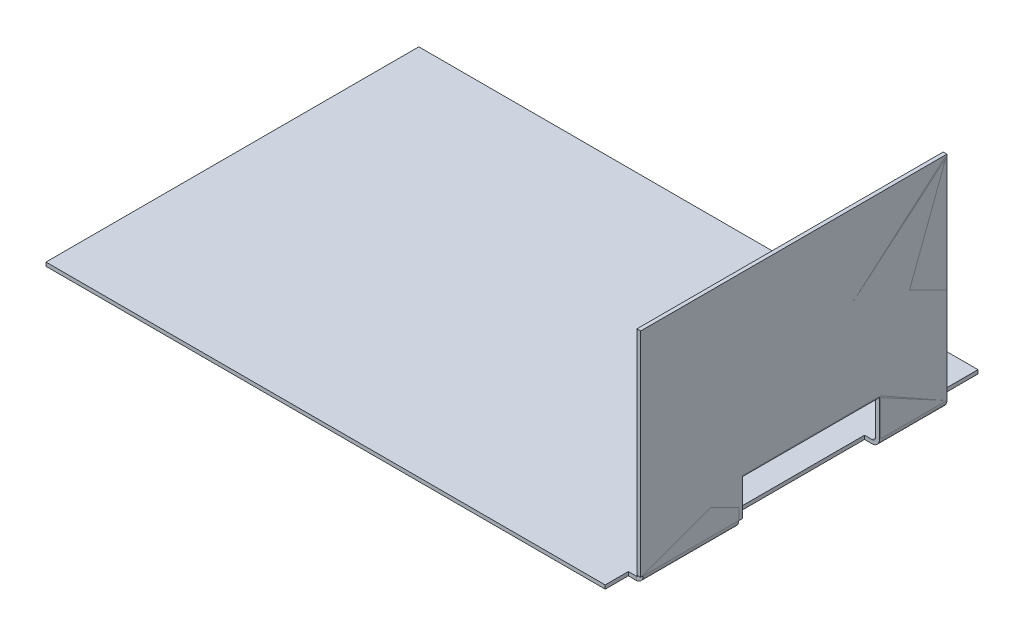
ISO-10303-21;
HEADER;
FILE_DESCRIPTION(('STEP AP214'),'2;1');
FILE_NAME('part.step','',(''),(''),'','','');
FILE_SCHEMA(('AUTOMOTIVE_DESIGN { 1 0 10303 214 1 1 1 1 }'));
ENDSEC;
DATA;
#1=APPLICATION_CONTEXT('core data for automotive mechanical design processes');
#2=APPLICATION_PROTOCOL_DEFINITION('international standard','automotive_design',2000,#1);
#3=PRODUCT_CONTEXT('',#1,'mechanical');
#4=PRODUCT('Part','Part','',(#3));
#5=PRODUCT_RELATED_PRODUCT_CATEGORY('part','',(#4));
#6=PRODUCT_DEFINITION_FORMATION('','',#4);
#7=PRODUCT_DEFINITION_CONTEXT('part definition',#1,'design');
#8=PRODUCT_DEFINITION('design','',#6,#7);
#9=PRODUCT_DEFINITION_SHAPE('','',#8);
#10=(LENGTH_UNIT() NAMED_UNIT(*) SI_UNIT(.MILLI.,.METRE.));
#11=(NAMED_UNIT(*) PLANE_ANGLE_UNIT() SI_UNIT($,.RADIAN.));
#12=(NAMED_UNIT(*) SI_UNIT($,.STERADIAN.) SOLID_ANGLE_UNIT());
#13=UNCERTAINTY_MEASURE_WITH_UNIT(LENGTH_MEASURE(1.E-05),#10,'distance_accuracy_value','');
#14=(GEOMETRIC_REPRESENTATION_CONTEXT(3) GLOBAL_UNCERTAINTY_ASSIGNED_CONTEXT((#13)) GLOBAL_UNIT_ASSIGNED_CONTEXT((#10,
#11,#12)) REPRESENTATION_CONTEXT('',''));
#15=CARTESIAN_POINT('',(0.,0.,0.));
#16=DIRECTION('',(0.,0.,1.));
#17=DIRECTION('',(1.,0.,0.));
#18=AXIS2_PLACEMENT_3D('',#15,#16,#17);
#19=CARTESIAN_POINT('',(79.,58.2335739107928,44.4859608868171));
#20=DIRECTION('',(0.,1.,0.));
#21=DIRECTION('',(0.,0.,1.));
#22=AXIS2_PLACEMENT_3D('',#19,#20,#21);
#23=PLANE('',#22);
#24=DIRECTION('',(0.,0.,-1.));
#25=VECTOR('',#24,1.);
#26=CARTESIAN_POINT('',(78.,58.2335739107928,44.4859608868171));
#27=LINE('',#26,#25);
#28=CARTESIAN_POINT('',(78.,58.2335739107928,44.4859608868171));
#29=VERTEX_POINT('',#28);
#30=CARTESIAN_POINT('',(78.,58.2335739107928,-37.6507989938659));
#31=VERTEX_POINT('',#30);
#32=EDGE_CURVE('E167',#29,#31,#27,.T.);
#33=ORIENTED_EDGE('',*,*,#32,.F.);
#34=DIRECTION('',(-1.,0.,0.));
#35=VECTOR('',#34,1.);
#36=CARTESIAN_POINT('',(79.,58.2335739107928,44.4859608868171));
#37=LINE('',#36,#35);
#38=CARTESIAN_POINT('',(79.,58.2335739107928,44.4859608868171));
#39=VERTEX_POINT('',#38);
#40=EDGE_CURVE('E14',#39,#29,#37,.T.);
#41=ORIENTED_EDGE('',*,*,#40,.F.);
#42=DIRECTION('',(0.,0.,-1.));
#43=VECTOR('',#42,1.);
#44=CARTESIAN_POINT('',(79.,58.2335739107928,44.4859608868171));
#45=LINE('',#44,#43);
#46=CARTESIAN_POINT('',(79.,58.2335739107928,-37.6507989938659));
#47=VERTEX_POINT('',#46);
#48=EDGE_CURVE('E183',#39,#47,#45,.T.);
#49=ORIENTED_EDGE('',*,*,#48,.T.);
#50=DIRECTION('',(-1.,0.,0.));
#51=VECTOR('',#50,1.);
#52=CARTESIAN_POINT('',(79.,58.2335739107928,-37.6507989938659));
#53=LINE('',#52,#51);
#54=EDGE_CURVE('E72',#47,#31,#53,.T.);
#55=ORIENTED_EDGE('',*,*,#54,.T.);
#56=EDGE_LOOP('',(#33,#41,#49,#55));
#57=FACE_BOUND('',#56,.T.);
#58=ADVANCED_FACE('F69',(#57),#23,.T.);
#59=CARTESIAN_POINT('',(79.,58.2335739107928,44.4859608868171));
#60=DIRECTION('',(0.,0.,-1.));
#61=DIRECTION('',(-1.,0.,0.));
#62=AXIS2_PLACEMENT_3D('',#59,#60,#61);
#63=PLANE('',#62);
#64=DIRECTION('',(0.,-1.,0.));
#65=VECTOR('',#64,1.);
#66=CARTESIAN_POINT('',(78.,58.2335739107928,44.4859608868171));
#67=LINE('',#66,#65);
#68=CARTESIAN_POINT('',(78.,1.,44.4859608868171));
#69=VERTEX_POINT('',#68);
#70=EDGE_CURVE('E114',#29,#69,#67,.T.);
#71=ORIENTED_EDGE('',*,*,#70,.T.);
#72=DIRECTION('',(-1.,0.,0.));
#73=VECTOR('',#72,1.);
#74=CARTESIAN_POINT('',(79.,1.,44.4859608868171));
#75=LINE('',#74,#73);
#76=CARTESIAN_POINT('',(79.,1.,44.4859608868171));
#77=VERTEX_POINT('',#76);
#78=EDGE_CURVE('E78',#77,#69,#75,.T.);
#79=ORIENTED_EDGE('',*,*,#78,.F.);
#80=DIRECTION('',(0.,-1.,0.));
#81=VECTOR('',#80,1.);
#82=CARTESIAN_POINT('',(79.,58.2335739107928,44.4859608868171));
#83=LINE('',#82,#81);
#84=EDGE_CURVE('E145',#39,#77,#83,.T.);
#85=ORIENTED_EDGE('',*,*,#84,.F.);
#86=ORIENTED_EDGE('',*,*,#40,.T.);
#87=EDGE_LOOP('',(#71,#79,#85,#86));
#88=FACE_BOUND('',#87,.T.);
#89=ADVANCED_FACE('F223',(#88),#63,.F.);
#90=CARTESIAN_POINT('',(79.,1.,44.4859608868171));
#91=DIRECTION('',(0.,1.,0.));
#92=DIRECTION('',(0.,0.,1.));
#93=AXIS2_PLACEMENT_3D('',#90,#91,#92);
#94=PLANE('',#93);
#95=DIRECTION('',(0.,0.,-1.));
#96=VECTOR('',#95,1.);
#97=CARTESIAN_POINT('',(78.,1.,44.4859608868171));
#98=LINE('',#97,#96);
#99=CARTESIAN_POINT('',(78.,1.,17.1097125478177));
#100=VERTEX_POINT('',#99);
#101=EDGE_CURVE('E152',#69,#100,#98,.T.);
#102=ORIENTED_EDGE('',*,*,#101,.T.);
#103=DIRECTION('',(-1.,0.,0.));
#104=VECTOR('',#103,1.);
#105=CARTESIAN_POINT('',(79.,1.,17.1097125478177));
#106=LINE('',#105,#104);
#107=CARTESIAN_POINT('',(79.,1.,17.1097125478177));
#108=VERTEX_POINT('',#107);
#109=EDGE_CURVE('E149',#108,#100,#106,.T.);
#110=ORIENTED_EDGE('',*,*,#109,.F.);
#111=DIRECTION('',(0.,0.,-1.));
#112=VECTOR('',#111,1.);
#113=CARTESIAN_POINT('',(79.,1.,44.4859608868171));
#114=LINE('',#113,#112);
#115=EDGE_CURVE('E138',#77,#108,#114,.T.);
#116=ORIENTED_EDGE('',*,*,#115,.F.);
#117=ORIENTED_EDGE('',*,*,#78,.T.);
#118=EDGE_LOOP('',(#102,#110,#116,#117));
#119=FACE_BOUND('',#118,.T.);
#120=ADVANCED_FACE('F150',(#119),#94,.F.);
#121=CARTESIAN_POINT('',(79.,1.,17.1097125478177));
#122=DIRECTION('',(0.,0.,1.));
#123=DIRECTION('',(1.,0.,0.));
#124=AXIS2_PLACEMENT_3D('',#121,#122,#123);
#125=PLANE('',#124);
#126=DIRECTION('',(0.,1.,0.));
#127=VECTOR('',#126,1.);
#128=CARTESIAN_POINT('',(78.,1.,17.1097125478177));
#129=LINE('',#128,#127);
#130=CARTESIAN_POINT('',(78.,10.9986856522136,17.1097125478177));
#131=VERTEX_POINT('',#130);
#132=EDGE_CURVE('E180',#100,#131,#129,.T.);
#133=ORIENTED_EDGE('',*,*,#132,.T.);
#134=DIRECTION('',(-1.,0.,0.));
#135=VECTOR('',#134,1.);
#136=CARTESIAN_POINT('',(79.,10.9986856522136,17.1097125478177));
#137=LINE('',#136,#135);
#138=CARTESIAN_POINT('',(79.,10.9986856522136,17.1097125478177));
#139=VERTEX_POINT('',#138);
#140=EDGE_CURVE('E155',#139,#131,#137,.T.);
#141=ORIENTED_EDGE('',*,*,#140,.F.);
#142=DIRECTION('',(0.,1.,0.));
#143=VECTOR('',#142,1.);
#144=CARTESIAN_POINT('',(79.,1.,17.1097125478177));
#145=LINE('',#144,#143);
#146=EDGE_CURVE('E143',#108,#139,#145,.T.);
#147=ORIENTED_EDGE('',*,*,#146,.F.);
#148=ORIENTED_EDGE('',*,*,#109,.T.);
#149=EDGE_LOOP('',(#133,#141,#147,#148));
#150=FACE_BOUND('',#149,.T.);
#151=ADVANCED_FACE('F157',(#150),#125,.F.);
#152=CARTESIAN_POINT('',(79.,10.9986856522136,17.1097125478177));
#153=DIRECTION('',(0.,1.,0.));
#154=DIRECTION('',(0.,0.,1.));
#155=AXIS2_PLACEMENT_3D('',#152,#153,#154);
#156=PLANE('',#155);
#157=DIRECTION('',(0.,0.,-1.));
#158=VECTOR('',#157,1.);
#159=CARTESIAN_POINT('',(78.,10.9986856522136,17.1097125478177));
#160=LINE('',#159,#158);
#161=CARTESIAN_POINT('',(78.,10.9986856522136,-19.8482134290394));
#162=VERTEX_POINT('',#161);
#163=EDGE_CURVE('E178',#131,#162,#160,.T.);
#164=ORIENTED_EDGE('',*,*,#163,.T.);
#165=DIRECTION('',(-1.,0.,0.));
#166=VECTOR('',#165,1.);
#167=CARTESIAN_POINT('',(79.,10.9986856522136,-19.8482134290394));
#168=LINE('',#167,#166);
#169=CARTESIAN_POINT('',(79.,10.9986856522136,-19.8482134290394));
#170=VERTEX_POINT('',#169);
#171=EDGE_CURVE('E187',#170,#162,#168,.T.);
#172=ORIENTED_EDGE('',*,*,#171,.F.);
#173=DIRECTION('',(0.,0.,-1.));
#174=VECTOR('',#173,1.);
#175=CARTESIAN_POINT('',(79.,10.9986856522136,17.1097125478177));
#176=LINE('',#175,#174);
#177=EDGE_CURVE('E160',#139,#170,#176,.T.);
#178=ORIENTED_EDGE('',*,*,#177,.F.);
#179=ORIENTED_EDGE('',*,*,#140,.T.);
#180=EDGE_LOOP('',(#164,#172,#178,#179));
#181=FACE_BOUND('',#180,.T.);
#182=ADVANCED_FACE('F201',(#181),#156,.F.);
#183=CARTESIAN_POINT('',(79.,10.9986856522136,-19.8482134290394));
#184=DIRECTION('',(0.,0.,-1.));
#185=DIRECTION('',(-1.,0.,0.));
#186=AXIS2_PLACEMENT_3D('',#183,#184,#185);
#187=PLANE('',#186);
#188=DIRECTION('',(0.,-1.,0.));
#189=VECTOR('',#188,1.);
#190=CARTESIAN_POINT('',(78.,10.9986856522136,-19.8482134290394));
#191=LINE('',#190,#189);
#192=CARTESIAN_POINT('',(78.,1.,-19.8482134290394));
#193=VERTEX_POINT('',#192);
#194=EDGE_CURVE('E176',#162,#193,#191,.T.);
#195=ORIENTED_EDGE('',*,*,#194,.T.);
#196=DIRECTION('',(-1.,0.,0.));
#197=VECTOR('',#196,1.);
#198=CARTESIAN_POINT('',(79.,1.,-19.8482134290394));
#199=LINE('',#198,#197);
#200=CARTESIAN_POINT('',(79.,1.,-19.8482134290394));
#201=VERTEX_POINT('',#200);
#202=EDGE_CURVE('E190',#201,#193,#199,.T.);
#203=ORIENTED_EDGE('',*,*,#202,.F.);
#204=DIRECTION('',(0.,-1.,0.));
#205=VECTOR('',#204,1.);
#206=CARTESIAN_POINT('',(79.,10.9986856522136,-19.8482134290394));
#207=LINE('',#206,#205);
#208=EDGE_CURVE('E162',#170,#201,#207,.T.);
#209=ORIENTED_EDGE('',*,*,#208,.F.);
#210=ORIENTED_EDGE('',*,*,#171,.T.);
#211=EDGE_LOOP('',(#195,#203,#209,#210));
#212=FACE_BOUND('',#211,.T.);
#213=ADVANCED_FACE('F208',(#212),#187,.F.);
#214=CARTESIAN_POINT('',(79.,1.,-19.8482134290394));
#215=DIRECTION('',(0.,1.,0.));
#216=DIRECTION('',(0.,0.,1.));
#217=AXIS2_PLACEMENT_3D('',#214,#215,#216);
#218=PLANE('',#217);
#219=DIRECTION('',(0.,0.,-1.));
#220=VECTOR('',#219,1.);
#221=CARTESIAN_POINT('',(78.,1.,-19.8482134290394));
#222=LINE('',#221,#220);
#223=CARTESIAN_POINT('',(78.,1.,-37.6507989938659));
#224=VERTEX_POINT('',#223);
#225=EDGE_CURVE('E173',#193,#224,#222,.T.);
#226=ORIENTED_EDGE('',*,*,#225,.T.);
#227=DIRECTION('',(-1.,0.,0.));
#228=VECTOR('',#227,1.);
#229=CARTESIAN_POINT('',(79.,1.,-37.6507989938659));
#230=LINE('',#229,#228);
#231=CARTESIAN_POINT('',(79.,1.,-37.6507989938659));
#232=VERTEX_POINT('',#231);
#233=EDGE_CURVE('E192',#232,#224,#230,.T.);
#234=ORIENTED_EDGE('',*,*,#233,.F.);
#235=DIRECTION('',(0.,0.,-1.));
#236=VECTOR('',#235,1.);
#237=CARTESIAN_POINT('',(79.,1.,-19.8482134290394));
#238=LINE('',#237,#236);
#239=EDGE_CURVE('E206',#201,#232,#238,.T.);
#240=ORIENTED_EDGE('',*,*,#239,.F.);
#241=ORIENTED_EDGE('',*,*,#202,.T.);
#242=EDGE_LOOP('',(#226,#234,#240,#241));
#243=FACE_BOUND('',#242,.T.);
#244=ADVANCED_FACE('F210',(#243),#218,.F.);
#245=CARTESIAN_POINT('',(79.,58.2335739107928,-37.6507989938659));
#246=DIRECTION('',(0.,0.,-1.));
#247=DIRECTION('',(-1.,0.,0.));
#248=AXIS2_PLACEMENT_3D('',#245,#246,#247);
#249=PLANE('',#248);
#250=DIRECTION('',(0.,-1.,0.));
#251=VECTOR('',#250,1.);
#252=CARTESIAN_POINT('',(78.,58.2335739107928,-37.6507989938659));
#253=LINE('',#252,#251);
#254=EDGE_CURVE('E170',#31,#224,#253,.T.);
#255=ORIENTED_EDGE('',*,*,#254,.F.);
#256=ORIENTED_EDGE('',*,*,#54,.F.);
#257=DIRECTION('',(0.,-1.,0.));
#258=VECTOR('',#257,1.);
#259=CARTESIAN_POINT('',(79.,58.2335739107928,-37.6507989938659));
#260=LINE('',#259,#258);
#261=EDGE_CURVE('E211',#47,#232,#260,.T.);
#262=ORIENTED_EDGE('',*,*,#261,.T.);
#263=ORIENTED_EDGE('',*,*,#233,.T.);
#264=EDGE_LOOP('',(#255,#256,#262,#263));
#265=FACE_BOUND('',#264,.T.);
#266=ADVANCED_FACE('F194',(#265),#249,.T.);
#267=CARTESIAN_POINT('',(79.,0.,0.));
#268=DIRECTION('',(-1.,0.,0.));
#269=DIRECTION('',(0.,0.,1.));
#270=AXIS2_PLACEMENT_3D('',#267,#268,#269);
#271=PLANE('',#270);
#272=ORIENTED_EDGE('',*,*,#48,.F.);
#273=ORIENTED_EDGE('',*,*,#84,.T.);
#274=ORIENTED_EDGE('',*,*,#115,.T.);
#275=ORIENTED_EDGE('',*,*,#146,.T.);
#276=ORIENTED_EDGE('',*,*,#177,.T.);
#277=ORIENTED_EDGE('',*,*,#208,.T.);
#278=ORIENTED_EDGE('',*,*,#239,.T.);
#279=ORIENTED_EDGE('',*,*,#261,.F.);
#280=EDGE_LOOP('',(#272,#273,#274,#275,#276,#277,#278,#279));
#281=FACE_BOUND('',#280,.T.);
#282=ADVANCED_FACE('F141',(#281),#271,.F.);
#283=CARTESIAN_POINT('',(78.,0.,0.));
#284=DIRECTION('',(-1.,0.,0.));
#285=DIRECTION('',(0.,0.,1.));
#286=AXIS2_PLACEMENT_3D('',#283,#284,#285);
#287=PLANE('',#286);
#288=ORIENTED_EDGE('',*,*,#32,.T.);
#289=ORIENTED_EDGE('',*,*,#254,.T.);
#290=ORIENTED_EDGE('',*,*,#225,.F.);
#291=ORIENTED_EDGE('',*,*,#194,.F.);
#292=ORIENTED_EDGE('',*,*,#163,.F.);
#293=ORIENTED_EDGE('',*,*,#132,.F.);
#294=ORIENTED_EDGE('',*,*,#101,.F.);
#295=ORIENTED_EDGE('',*,*,#70,.F.);
#296=EDGE_LOOP('',(#288,#289,#290,#291,#292,#293,#294,#295));
#297=FACE_BOUND('',#296,.T.);
#298=ADVANCED_FACE('F197',(#297),#287,.T.);
#299=CLOSED_SHELL('',(#58,#89,#120,#151,#182,#213,#244,#266,#282,#298));
#300=MANIFOLD_SOLID_BREP('B2',#299);
#301=CARTESIAN_POINT('',(77.,1.,-37.6547539770673));
#302=DIRECTION('',(0.,0.,-1.));
#303=DIRECTION('',(1.,0.,0.));
#304=AXIS2_PLACEMENT_3D('',#301,#302,#303);
#305=CYLINDRICAL_SURFACE('',#304,2.);
#306=CARTESIAN_POINT('',(77.,1.,18.1700229367721));
#307=DIRECTION('',(0.,0.,1.));
#308=DIRECTION('',(1.,0.,0.));
#309=AXIS2_PLACEMENT_3D('',#306,#307,#308);
#310=CIRCLE('',#309,2.);
#311=CARTESIAN_POINT('',(79.,0.999999999999995,18.1700229367721));
#312=VERTEX_POINT('',#311);
#313=CARTESIAN_POINT('',(77.,-0.999999999999996,18.1700229367721));
#314=VERTEX_POINT('',#313);
#315=EDGE_CURVE('E470',#312,#314,#310,.F.);
#316=ORIENTED_EDGE('',*,*,#315,.F.);
#317=DIRECTION('',(0.,0.,-1.));
#318=VECTOR('',#317,1.);
#319=CARTESIAN_POINT('',(79.,0.999999999999997,0.));
#320=LINE('',#319,#318);
#321=CARTESIAN_POINT('',(79.,0.999999999999997,43.7944950333478));
#322=VERTEX_POINT('',#321);
#323=EDGE_CURVE('E500',#322,#312,#320,.T.);
#324=ORIENTED_EDGE('',*,*,#323,.F.);
#325=CARTESIAN_POINT('',(77.,1.,43.7944950333478));
#326=DIRECTION('',(0.,0.,-1.));
#327=DIRECTION('',(-1.,0.,0.));
#328=AXIS2_PLACEMENT_3D('',#325,#326,#327);
#329=CIRCLE('',#328,2.);
#330=CARTESIAN_POINT('',(77.,-0.999999999999996,43.7944950333478));
#331=VERTEX_POINT('',#330);
#332=EDGE_CURVE('E515',#331,#322,#329,.F.);
#333=ORIENTED_EDGE('',*,*,#332,.F.);
#334=DIRECTION('',(0.,0.,-1.));
#335=VECTOR('',#334,1.);
#336=CARTESIAN_POINT('',(77.,-0.999999999999996,-37.6547539770673));
#337=LINE('',#336,#335);
#338=EDGE_CURVE('E516',#314,#331,#337,.F.);
#339=ORIENTED_EDGE('',*,*,#338,.F.);
#340=EDGE_LOOP('',(#316,#324,#333,#339));
#341=FACE_BOUND('',#340,.T.);
#342=ADVANCED_FACE('F297',(#341),#305,.T.);
#343=CARTESIAN_POINT('',(77.,1.,-37.6547539770673));
#344=DIRECTION('',(0.,0.,-1.));
#345=DIRECTION('',(1.,0.,0.));
#346=AXIS2_PLACEMENT_3D('',#343,#344,#345);
#347=CYLINDRICAL_SURFACE('',#346,1.);
#348=DIRECTION('',(0.,0.,1.));
#349=VECTOR('',#348,1.);
#350=CARTESIAN_POINT('',(78.,1.,43.7944950333478));
#351=LINE('',#350,#349);
#352=CARTESIAN_POINT('',(78.,1.,43.7944950333478));
#353=VERTEX_POINT('',#352);
#354=CARTESIAN_POINT('',(78.,0.999999999999999,18.1700229367721));
#355=VERTEX_POINT('',#354);
#356=EDGE_CURVE('E506',#353,#355,#351,.F.);
#357=ORIENTED_EDGE('',*,*,#356,.T.);
#358=CARTESIAN_POINT('',(77.,1.,18.1700229367721));
#359=DIRECTION('',(0.,0.,1.));
#360=DIRECTION('',(1.,0.,0.));
#361=AXIS2_PLACEMENT_3D('',#358,#359,#360);
#362=CIRCLE('',#361,1.);
#363=CARTESIAN_POINT('',(77.,0.,18.1700229367721));
#364=VERTEX_POINT('',#363);
#365=EDGE_CURVE('E465',#355,#364,#362,.F.);
#366=ORIENTED_EDGE('',*,*,#365,.T.);
#367=DIRECTION('',(0.,0.,-1.));
#368=VECTOR('',#367,1.);
#369=CARTESIAN_POINT('',(77.,0.,-37.6547539770673));
#370=LINE('',#369,#368);
#371=CARTESIAN_POINT('',(77.,0.,43.7944950333478));
#372=VERTEX_POINT('',#371);
#373=EDGE_CURVE('E529',#364,#372,#370,.F.);
#374=ORIENTED_EDGE('',*,*,#373,.T.);
#375=CARTESIAN_POINT('',(77.,1.,43.7944950333478));
#376=DIRECTION('',(0.,0.,-1.));
#377=DIRECTION('',(-1.,0.,0.));
#378=AXIS2_PLACEMENT_3D('',#375,#376,#377);
#379=CIRCLE('',#378,1.);
#380=EDGE_CURVE('E523',#372,#353,#379,.F.);
#381=ORIENTED_EDGE('',*,*,#380,.T.);
#382=EDGE_LOOP('',(#357,#366,#374,#381));
#383=FACE_BOUND('',#382,.T.);
#384=ADVANCED_FACE('F595',(#383),#347,.F.);
#385=CARTESIAN_POINT('',(75.,-1.,-50.));
#386=DIRECTION('',(1.,0.,0.));
#387=DIRECTION('',(0.,0.,-1.));
#388=AXIS2_PLACEMENT_3D('',#385,#386,#387);
#389=PLANE('',#388);
#390=DIRECTION('',(0.,0.,-1.));
#391=VECTOR('',#390,1.);
#392=CARTESIAN_POINT('',(75.,0.,-50.));
#393=LINE('',#392,#391);
#394=CARTESIAN_POINT('',(75.,0.,-37.6547539770673));
#395=VERTEX_POINT('',#394);
#396=CARTESIAN_POINT('',(75.,0.,-50.));
#397=VERTEX_POINT('',#396);
#398=EDGE_CURVE('E572',#395,#397,#393,.T.);
#399=ORIENTED_EDGE('',*,*,#398,.F.);
#400=DIRECTION('',(0.,-1.,0.));
#401=VECTOR('',#400,1.);
#402=CARTESIAN_POINT('',(75.,0.,-37.6547539770673));
#403=LINE('',#402,#401);
#404=CARTESIAN_POINT('',(75.,-1.,-37.6547539770673));
#405=VERTEX_POINT('',#404);
#406=EDGE_CURVE('E540',#395,#405,#403,.T.);
#407=ORIENTED_EDGE('',*,*,#406,.T.);
#408=DIRECTION('',(0.,0.,-1.));
#409=VECTOR('',#408,1.);
#410=CARTESIAN_POINT('',(75.,-1.,-50.));
#411=LINE('',#410,#409);
#412=CARTESIAN_POINT('',(75.,-1.,-50.));
#413=VERTEX_POINT('',#412);
#414=EDGE_CURVE('E559',#405,#413,#411,.T.);
#415=ORIENTED_EDGE('',*,*,#414,.T.);
#416=DIRECTION('',(0.,1.,0.));
#417=VECTOR('',#416,1.);
#418=CARTESIAN_POINT('',(75.,-1.,-50.));
#419=LINE('',#418,#417);
#420=EDGE_CURVE('E581',#413,#397,#419,.T.);
#421=ORIENTED_EDGE('',*,*,#420,.T.);
#422=EDGE_LOOP('',(#399,#407,#415,#421));
#423=FACE_BOUND('',#422,.T.);
#424=ADVANCED_FACE('F671',(#423),#389,.T.);
#425=CARTESIAN_POINT('',(-75.,-1.,-50.));
#426=DIRECTION('',(-1.,0.,0.));
#427=DIRECTION('',(0.,0.,1.));
#428=AXIS2_PLACEMENT_3D('',#425,#426,#427);
#429=PLANE('',#428);
#430=DIRECTION('',(0.,0.,1.));
#431=VECTOR('',#430,1.);
#432=CARTESIAN_POINT('',(-75.,0.,-50.));
#433=LINE('',#432,#431);
#434=CARTESIAN_POINT('',(-75.,0.,-50.));
#435=VERTEX_POINT('',#434);
#436=CARTESIAN_POINT('',(-75.,0.,50.));
#437=VERTEX_POINT('',#436);
#438=EDGE_CURVE('E550',#435,#437,#433,.T.);
#439=ORIENTED_EDGE('',*,*,#438,.F.);
#440=DIRECTION('',(0.,1.,0.));
#441=VECTOR('',#440,1.);
#442=CARTESIAN_POINT('',(-75.,-1.,-50.));
#443=LINE('',#442,#441);
#444=CARTESIAN_POINT('',(-75.,-1.,-50.));
#445=VERTEX_POINT('',#444);
#446=EDGE_CURVE('E578',#445,#435,#443,.T.);
#447=ORIENTED_EDGE('',*,*,#446,.F.);
#448=DIRECTION('',(0.,0.,1.));
#449=VECTOR('',#448,1.);
#450=CARTESIAN_POINT('',(-75.,-1.,-50.));
#451=LINE('',#450,#449);
#452=CARTESIAN_POINT('',(-75.,-1.,50.));
#453=VERTEX_POINT('',#452);
#454=EDGE_CURVE('E552',#445,#453,#451,.T.);
#455=ORIENTED_EDGE('',*,*,#454,.T.);
#456=DIRECTION('',(0.,1.,0.));
#457=VECTOR('',#456,1.);
#458=CARTESIAN_POINT('',(-75.,-1.,50.));
#459=LINE('',#458,#457);
#460=EDGE_CURVE('E566',#453,#437,#459,.T.);
#461=ORIENTED_EDGE('',*,*,#460,.T.);
#462=EDGE_LOOP('',(#439,#447,#455,#461));
#463=FACE_BOUND('',#462,.T.);
#464=ADVANCED_FACE('F299',(#463),#429,.T.);
#465=CARTESIAN_POINT('',(-75.,-1.,-50.));
#466=DIRECTION('',(0.,0.,-1.));
#467=DIRECTION('',(-1.,0.,0.));
#468=AXIS2_PLACEMENT_3D('',#465,#466,#467);
#469=PLANE('',#468);
#470=DIRECTION('',(-1.,0.,0.));
#471=VECTOR('',#470,1.);
#472=CARTESIAN_POINT('',(-75.,0.,-50.));
#473=LINE('',#472,#471);
#474=EDGE_CURVE('E556',#397,#435,#473,.T.);
#475=ORIENTED_EDGE('',*,*,#474,.F.);
#476=ORIENTED_EDGE('',*,*,#420,.F.);
#477=DIRECTION('',(-1.,0.,0.));
#478=VECTOR('',#477,1.);
#479=CARTESIAN_POINT('',(-75.,-1.,-50.));
#480=LINE('',#479,#478);
#481=EDGE_CURVE('E563',#413,#445,#480,.T.);
#482=ORIENTED_EDGE('',*,*,#481,.T.);
#483=ORIENTED_EDGE('',*,*,#446,.T.);
#484=EDGE_LOOP('',(#475,#476,#482,#483));
#485=FACE_BOUND('',#484,.T.);
#486=ADVANCED_FACE('F690',(#485),#469,.T.);
#487=DIRECTION('',(0.,-1.,0.));
#488=VECTOR('',#487,1.);
#489=CARTESIAN_POINT('',(75.,0.,43.7944950333478));
#490=LINE('',#489,#488);
#491=CARTESIAN_POINT('',(75.,0.,43.7944950333478));
#492=VERTEX_POINT('',#491);
#493=CARTESIAN_POINT('',(75.,-0.999999999999996,43.7944950333478));
#494=VERTEX_POINT('',#493);
#495=EDGE_CURVE('E535',#492,#494,#490,.T.);
#496=ORIENTED_EDGE('',*,*,#495,.F.);
#497=CARTESIAN_POINT('',(75.,0.,50.));
#498=VERTEX_POINT('',#497);
#499=EDGE_CURVE('E573',#498,#492,#393,.T.);
#500=ORIENTED_EDGE('',*,*,#499,.F.);
#501=DIRECTION('',(0.,1.,0.));
#502=VECTOR('',#501,1.);
#503=CARTESIAN_POINT('',(75.,-1.,50.));
#504=LINE('',#503,#502);
#505=CARTESIAN_POINT('',(75.,-1.,50.));
#506=VERTEX_POINT('',#505);
#507=EDGE_CURVE('E584',#506,#498,#504,.T.);
#508=ORIENTED_EDGE('',*,*,#507,.F.);
#509=EDGE_CURVE('E560',#506,#494,#411,.T.);
#510=ORIENTED_EDGE('',*,*,#509,.T.);
#511=EDGE_LOOP('',(#496,#500,#508,#510));
#512=FACE_BOUND('',#511,.T.);
#513=ADVANCED_FACE('F677',(#512),#389,.T.);
#514=CARTESIAN_POINT('',(-75.,-1.,50.));
#515=DIRECTION('',(0.,0.,1.));
#516=DIRECTION('',(1.,0.,0.));
#517=AXIS2_PLACEMENT_3D('',#514,#515,#516);
#518=PLANE('',#517);
#519=DIRECTION('',(1.,0.,0.));
#520=VECTOR('',#519,1.);
#521=CARTESIAN_POINT('',(-75.,0.,50.));
#522=LINE('',#521,#520);
#523=EDGE_CURVE('E569',#437,#498,#522,.T.);
#524=ORIENTED_EDGE('',*,*,#523,.F.);
#525=ORIENTED_EDGE('',*,*,#460,.F.);
#526=DIRECTION('',(1.,0.,0.));
#527=VECTOR('',#526,1.);
#528=CARTESIAN_POINT('',(-75.,-1.,50.));
#529=LINE('',#528,#527);
#530=EDGE_CURVE('E555',#453,#506,#529,.T.);
#531=ORIENTED_EDGE('',*,*,#530,.T.);
#532=ORIENTED_EDGE('',*,*,#507,.T.);
#533=EDGE_LOOP('',(#524,#525,#531,#532));
#534=FACE_BOUND('',#533,.T.);
#535=ADVANCED_FACE('F687',(#534),#518,.T.);
#536=CARTESIAN_POINT('',(0.,-1.,0.));
#537=DIRECTION('',(0.,1.,0.));
#538=DIRECTION('',(0.,0.,1.));
#539=AXIS2_PLACEMENT_3D('',#536,#537,#538);
#540=PLANE('',#539);
#541=DIRECTION('',(0.,0.,-1.));
#542=VECTOR('',#541,1.);
#543=CARTESIAN_POINT('',(75.,-1.,0.));
#544=LINE('',#543,#542);
#545=CARTESIAN_POINT('',(75.,-1.,18.1700229367721));
#546=VERTEX_POINT('',#545);
#547=CARTESIAN_POINT('',(75.,-1.,-19.5641606906065));
#548=VERTEX_POINT('',#547);
#549=EDGE_CURVE('E475',#546,#548,#544,.T.);
#550=ORIENTED_EDGE('',*,*,#549,.F.);
#551=DIRECTION('',(1.,0.,0.));
#552=VECTOR('',#551,1.);
#553=CARTESIAN_POINT('',(0.,-1.,18.1700229367721));
#554=LINE('',#553,#552);
#555=EDGE_CURVE('E472',#546,#314,#554,.T.);
#556=ORIENTED_EDGE('',*,*,#555,.T.);
#557=ORIENTED_EDGE('',*,*,#338,.T.);
#558=DIRECTION('',(-1.,0.,0.));
#559=VECTOR('',#558,1.);
#560=CARTESIAN_POINT('',(77.,-0.999999999999996,43.7944950333478));
#561=LINE('',#560,#559);
#562=EDGE_CURVE('E544',#331,#494,#561,.T.);
#563=ORIENTED_EDGE('',*,*,#562,.T.);
#564=ORIENTED_EDGE('',*,*,#509,.F.);
#565=ORIENTED_EDGE('',*,*,#530,.F.);
#566=ORIENTED_EDGE('',*,*,#454,.F.);
#567=ORIENTED_EDGE('',*,*,#481,.F.);
#568=ORIENTED_EDGE('',*,*,#414,.F.);
#569=DIRECTION('',(-1.,0.,0.));
#570=VECTOR('',#569,1.);
#571=CARTESIAN_POINT('',(77.,-0.999999999999996,-37.6547539770673));
#572=LINE('',#571,#570);
#573=CARTESIAN_POINT('',(77.,-0.999999999999996,-37.6547539770673));
#574=VERTEX_POINT('',#573);
#575=EDGE_CURVE('E546',#574,#405,#572,.T.);
#576=ORIENTED_EDGE('',*,*,#575,.F.);
#577=CARTESIAN_POINT('',(77.,-0.999999999999996,-19.5641606906065));
#578=VERTEX_POINT('',#577);
#579=EDGE_CURVE('E512',#574,#578,#337,.F.);
#580=ORIENTED_EDGE('',*,*,#579,.T.);
#581=DIRECTION('',(-1.,0.,0.));
#582=VECTOR('',#581,1.);
#583=CARTESIAN_POINT('',(0.,-1.,-19.5641606906065));
#584=LINE('',#583,#582);
#585=EDGE_CURVE('E462',#578,#548,#584,.T.);
#586=ORIENTED_EDGE('',*,*,#585,.T.);
#587=EDGE_LOOP('',(#550,#556,#557,#563,#564,#565,#566,#567,#568,#576,#580,#586));
#588=FACE_BOUND('',#587,.T.);
#589=ADVANCED_FACE('F613',(#588),#540,.F.);
#590=CARTESIAN_POINT('',(0.,0.,0.));
#591=DIRECTION('',(0.,1.,0.));
#592=DIRECTION('',(0.,0.,1.));
#593=AXIS2_PLACEMENT_3D('',#590,#591,#592);
#594=PLANE('',#593);
#595=DIRECTION('',(1.,0.,0.));
#596=VECTOR('',#595,1.);
#597=CARTESIAN_POINT('',(0.,0.,18.1700229367721));
#598=LINE('',#597,#596);
#599=CARTESIAN_POINT('',(75.,0.,18.1700229367721));
#600=VERTEX_POINT('',#599);
#601=EDGE_CURVE('E468',#600,#364,#598,.T.);
#602=ORIENTED_EDGE('',*,*,#601,.F.);
#603=DIRECTION('',(0.,0.,-1.));
#604=VECTOR('',#603,1.);
#605=CARTESIAN_POINT('',(75.,0.,0.));
#606=LINE('',#605,#604);
#607=CARTESIAN_POINT('',(75.,0.,-19.5641606906065));
#608=VERTEX_POINT('',#607);
#609=EDGE_CURVE('E67',#600,#608,#606,.T.);
#610=ORIENTED_EDGE('',*,*,#609,.T.);
#611=DIRECTION('',(-1.,0.,0.));
#612=VECTOR('',#611,1.);
#613=CARTESIAN_POINT('',(0.,0.,-19.5641606906065));
#614=LINE('',#613,#612);
#615=CARTESIAN_POINT('',(77.,0.,-19.5641606906065));
#616=VERTEX_POINT('',#615);
#617=EDGE_CURVE('E458',#616,#608,#614,.T.);
#618=ORIENTED_EDGE('',*,*,#617,.F.);
#619=CARTESIAN_POINT('',(77.,0.,-37.6547539770673));
#620=VERTEX_POINT('',#619);
#621=EDGE_CURVE('E526',#620,#616,#370,.F.);
#622=ORIENTED_EDGE('',*,*,#621,.F.);
#623=DIRECTION('',(-1.,0.,0.));
#624=VECTOR('',#623,1.);
#625=CARTESIAN_POINT('',(77.,0.,-37.6547539770673));
#626=LINE('',#625,#624);
#627=EDGE_CURVE('E548',#620,#395,#626,.T.);
#628=ORIENTED_EDGE('',*,*,#627,.T.);
#629=ORIENTED_EDGE('',*,*,#398,.T.);
#630=ORIENTED_EDGE('',*,*,#474,.T.);
#631=ORIENTED_EDGE('',*,*,#438,.T.);
#632=ORIENTED_EDGE('',*,*,#523,.T.);
#633=ORIENTED_EDGE('',*,*,#499,.T.);
#634=DIRECTION('',(-1.,0.,0.));
#635=VECTOR('',#634,1.);
#636=CARTESIAN_POINT('',(77.,0.,43.7944950333478));
#637=LINE('',#636,#635);
#638=EDGE_CURVE('E543',#372,#492,#637,.T.);
#639=ORIENTED_EDGE('',*,*,#638,.F.);
#640=ORIENTED_EDGE('',*,*,#373,.F.);
#641=EDGE_LOOP('',(#602,#610,#618,#622,#628,#629,#630,#631,#632,#633,#639,#640));
#642=FACE_BOUND('',#641,.T.);
#643=ADVANCED_FACE('F605',(#642),#594,.T.);
#644=CARTESIAN_POINT('',(77.,0.,-37.6547539770673));
#645=DIRECTION('',(0.,0.,-1.));
#646=DIRECTION('',(0.,-1.,0.));
#647=AXIS2_PLACEMENT_3D('',#644,#645,#646);
#648=PLANE('',#647);
#649=ORIENTED_EDGE('',*,*,#627,.F.);
#650=DIRECTION('',(0.,-1.,0.));
#651=VECTOR('',#650,1.);
#652=CARTESIAN_POINT('',(77.,0.,-37.6547539770673));
#653=LINE('',#652,#651);
#654=EDGE_CURVE('E519',#620,#574,#653,.T.);
#655=ORIENTED_EDGE('',*,*,#654,.T.);
#656=ORIENTED_EDGE('',*,*,#575,.T.);
#657=ORIENTED_EDGE('',*,*,#406,.F.);
#658=EDGE_LOOP('',(#649,#655,#656,#657));
#659=FACE_BOUND('',#658,.T.);
#660=ADVANCED_FACE('F644',(#659),#648,.T.);
#661=CARTESIAN_POINT('',(77.,0.,43.7944950333478));
#662=DIRECTION('',(0.,0.,-1.));
#663=DIRECTION('',(0.,-1.,0.));
#664=AXIS2_PLACEMENT_3D('',#661,#662,#663);
#665=PLANE('',#664);
#666=ORIENTED_EDGE('',*,*,#562,.F.);
#667=DIRECTION('',(0.,-1.,0.));
#668=VECTOR('',#667,1.);
#669=CARTESIAN_POINT('',(77.,0.,43.7944950333478));
#670=LINE('',#669,#668);
#671=EDGE_CURVE('E532',#372,#331,#670,.T.);
#672=ORIENTED_EDGE('',*,*,#671,.F.);
#673=ORIENTED_EDGE('',*,*,#638,.T.);
#674=ORIENTED_EDGE('',*,*,#495,.T.);
#675=EDGE_LOOP('',(#666,#672,#673,#674));
#676=FACE_BOUND('',#675,.T.);
#677=ADVANCED_FACE('F609',(#676),#665,.F.);
#678=CARTESIAN_POINT('',(77.,1.,43.7944950333478));
#679=DIRECTION('',(0.,0.,1.));
#680=DIRECTION('',(1.,0.,0.));
#681=AXIS2_PLACEMENT_3D('',#678,#679,#680);
#682=PLANE('',#681);
#683=DIRECTION('',(1.,0.,0.));
#684=VECTOR('',#683,1.);
#685=CARTESIAN_POINT('',(79.,0.999999999999994,43.7944950333478));
#686=LINE('',#685,#684);
#687=EDGE_CURVE('E477',#353,#322,#686,.T.);
#688=ORIENTED_EDGE('',*,*,#687,.F.);
#689=ORIENTED_EDGE('',*,*,#380,.F.);
#690=ORIENTED_EDGE('',*,*,#671,.T.);
#691=ORIENTED_EDGE('',*,*,#332,.T.);
#692=EDGE_LOOP('',(#688,#689,#690,#691));
#693=FACE_BOUND('',#692,.T.);
#694=ADVANCED_FACE('F600',(#693),#682,.T.);
#695=CARTESIAN_POINT('',(77.,1.,-37.6547539770673));
#696=DIRECTION('',(0.,0.,1.));
#697=DIRECTION('',(1.,0.,0.));
#698=AXIS2_PLACEMENT_3D('',#695,#696,#697);
#699=PLANE('',#698);
#700=CARTESIAN_POINT('',(77.,1.,-37.6547539770673));
#701=DIRECTION('',(0.,0.,-1.));
#702=DIRECTION('',(-1.,0.,0.));
#703=AXIS2_PLACEMENT_3D('',#700,#701,#702);
#704=CIRCLE('',#703,1.);
#705=CARTESIAN_POINT('',(78.,1.,-37.6547539770673));
#706=VERTEX_POINT('',#705);
#707=EDGE_CURVE('E480',#706,#620,#704,.T.);
#708=ORIENTED_EDGE('',*,*,#707,.F.);
#709=DIRECTION('',(1.,0.,0.));
#710=VECTOR('',#709,1.);
#711=CARTESIAN_POINT('',(78.,1.,-37.6547539770673));
#712=LINE('',#711,#710);
#713=CARTESIAN_POINT('',(79.,0.999999999999997,-37.6547539770673));
#714=VERTEX_POINT('',#713);
#715=EDGE_CURVE('E503',#706,#714,#712,.T.);
#716=ORIENTED_EDGE('',*,*,#715,.T.);
#717=CARTESIAN_POINT('',(77.,1.,-37.6547539770673));
#718=DIRECTION('',(0.,0.,-1.));
#719=DIRECTION('',(-1.,0.,0.));
#720=AXIS2_PLACEMENT_3D('',#717,#718,#719);
#721=CIRCLE('',#720,2.);
#722=EDGE_CURVE('E520',#714,#574,#721,.T.);
#723=ORIENTED_EDGE('',*,*,#722,.T.);
#724=ORIENTED_EDGE('',*,*,#654,.F.);
#725=EDGE_LOOP('',(#708,#716,#723,#724));
#726=FACE_BOUND('',#725,.T.);
#727=ADVANCED_FACE('F635',(#726),#699,.F.);
#728=CARTESIAN_POINT('',(77.,1.,-19.5641606906065));
#729=DIRECTION('',(0.,0.,-1.));
#730=DIRECTION('',(-1.,0.,0.));
#731=AXIS2_PLACEMENT_3D('',#728,#729,#730);
#732=CIRCLE('',#731,2.);
#733=CARTESIAN_POINT('',(79.,0.999999999999997,-19.5641606906065));
#734=VERTEX_POINT('',#733);
#735=EDGE_CURVE('E312',#578,#734,#732,.F.);
#736=ORIENTED_EDGE('',*,*,#735,.F.);
#737=ORIENTED_EDGE('',*,*,#579,.F.);
#738=ORIENTED_EDGE('',*,*,#722,.F.);
#739=EDGE_CURVE('E502',#734,#714,#320,.T.);
#740=ORIENTED_EDGE('',*,*,#739,.F.);
#741=EDGE_LOOP('',(#736,#737,#738,#740));
#742=FACE_BOUND('',#741,.T.);
#743=ADVANCED_FACE('F657',(#742),#305,.T.);
#744=ORIENTED_EDGE('',*,*,#621,.T.);
#745=CARTESIAN_POINT('',(77.,1.,-19.5641606906065));
#746=DIRECTION('',(0.,0.,-1.));
#747=DIRECTION('',(-1.,0.,0.));
#748=AXIS2_PLACEMENT_3D('',#745,#746,#747);
#749=CIRCLE('',#748,1.);
#750=CARTESIAN_POINT('',(78.,0.999999999999999,-19.5641606906065));
#751=VERTEX_POINT('',#750);
#752=EDGE_CURVE('E455',#616,#751,#749,.F.);
#753=ORIENTED_EDGE('',*,*,#752,.T.);
#754=EDGE_CURVE('E509',#751,#706,#351,.F.);
#755=ORIENTED_EDGE('',*,*,#754,.T.);
#756=ORIENTED_EDGE('',*,*,#707,.T.);
#757=EDGE_LOOP('',(#744,#753,#755,#756));
#758=FACE_BOUND('',#757,.T.);
#759=ADVANCED_FACE('F640',(#758),#347,.F.);
#760=CARTESIAN_POINT('',(79.,0.,-37.6547539770673));
#761=DIRECTION('',(0.,0.,-1.));
#762=DIRECTION('',(0.,1.,0.));
#763=AXIS2_PLACEMENT_3D('',#760,#761,#762);
#764=PLANE('',#763);
#765=DIRECTION('',(0.,-1.,0.));
#766=VECTOR('',#765,1.);
#767=CARTESIAN_POINT('',(79.,0.,-37.6547539770673));
#768=LINE('',#767,#766);
#769=CARTESIAN_POINT('',(79.0000000000002,57.655328455489,-37.6547539770673));
#770=VERTEX_POINT('',#769);
#771=EDGE_CURVE('E484',#770,#714,#768,.T.);
#772=ORIENTED_EDGE('',*,*,#771,.T.);
#773=ORIENTED_EDGE('',*,*,#715,.F.);
#774=DIRECTION('',(0.,1.,0.));
#775=VECTOR('',#774,1.);
#776=CARTESIAN_POINT('',(78.,-2.75322230431325E-13,-37.6547539770673));
#777=LINE('',#776,#775);
#778=CARTESIAN_POINT('',(78.0000000000002,57.655328455489,-37.6547539770673));
#779=VERTEX_POINT('',#778);
#780=EDGE_CURVE('E492',#779,#706,#777,.F.);
#781=ORIENTED_EDGE('',*,*,#780,.F.);
#782=DIRECTION('',(-1.,0.,0.));
#783=VECTOR('',#782,1.);
#784=CARTESIAN_POINT('',(79.0000000000002,57.655328455489,-37.6547539770673));
#785=LINE('',#784,#783);
#786=EDGE_CURVE('E478',#770,#779,#785,.T.);
#787=ORIENTED_EDGE('',*,*,#786,.F.);
#788=EDGE_LOOP('',(#772,#773,#781,#787));
#789=FACE_BOUND('',#788,.T.);
#790=ADVANCED_FACE('F632',(#789),#764,.T.);
#791=CARTESIAN_POINT('',(79.0000000000002,57.655328455489,43.7944950333478));
#792=DIRECTION('',(0.,0.,1.));
#793=DIRECTION('',(0.,-1.,0.));
#794=AXIS2_PLACEMENT_3D('',#791,#792,#793);
#795=PLANE('',#794);
#796=DIRECTION('',(0.,-1.,0.));
#797=VECTOR('',#796,1.);
#798=CARTESIAN_POINT('',(78.,-2.65519707185403E-13,43.7944950333478));
#799=LINE('',#798,#797);
#800=CARTESIAN_POINT('',(78.0000000000002,57.655328455489,43.7944950333478));
#801=VERTEX_POINT('',#800);
#802=EDGE_CURVE('E498',#353,#801,#799,.F.);
#803=ORIENTED_EDGE('',*,*,#802,.F.);
#804=ORIENTED_EDGE('',*,*,#687,.T.);
#805=DIRECTION('',(0.,1.,0.));
#806=VECTOR('',#805,1.);
#807=CARTESIAN_POINT('',(79.0000000000002,57.655328455489,43.7944950333478));
#808=LINE('',#807,#806);
#809=CARTESIAN_POINT('',(79.0000000000002,57.655328455489,43.7944950333478));
#810=VERTEX_POINT('',#809);
#811=EDGE_CURVE('E490',#322,#810,#808,.T.);
#812=ORIENTED_EDGE('',*,*,#811,.T.);
#813=DIRECTION('',(-1.,0.,0.));
#814=VECTOR('',#813,1.);
#815=CARTESIAN_POINT('',(79.0000000000002,57.655328455489,43.7944950333478));
#816=LINE('',#815,#814);
#817=EDGE_CURVE('E481',#810,#801,#816,.T.);
#818=ORIENTED_EDGE('',*,*,#817,.T.);
#819=EDGE_LOOP('',(#803,#804,#812,#818));
#820=FACE_BOUND('',#819,.T.);
#821=ADVANCED_FACE('F621',(#820),#795,.T.);
#822=CARTESIAN_POINT('',(79.,-2.74281913065278E-13,0.));
#823=DIRECTION('',(1.,0.,0.));
#824=DIRECTION('',(0.,1.,0.));
#825=AXIS2_PLACEMENT_3D('',#822,#823,#824);
#826=PLANE('',#825);
#827=DIRECTION('',(0.,-1.,0.));
#828=VECTOR('',#827,1.);
#829=CARTESIAN_POINT('',(79.,-1.9106104059577,18.1700229367721));
#830=LINE('',#829,#828);
#831=CARTESIAN_POINT('',(79.,10.7341621188365,18.1700229367721));
#832=VERTEX_POINT('',#831);
#833=EDGE_CURVE('E436',#832,#312,#830,.T.);
#834=ORIENTED_EDGE('',*,*,#833,.F.);
#835=DIRECTION('',(0.,0.,1.));
#836=VECTOR('',#835,1.);
#837=CARTESIAN_POINT('',(79.,10.7341621188365,18.1700229367721));
#838=LINE('',#837,#836);
#839=CARTESIAN_POINT('',(79.,10.7341621188365,-19.5641606906065));
#840=VERTEX_POINT('',#839);
#841=EDGE_CURVE('E435',#840,#832,#838,.T.);
#842=ORIENTED_EDGE('',*,*,#841,.F.);
#843=DIRECTION('',(0.,1.,0.));
#844=VECTOR('',#843,1.);
#845=CARTESIAN_POINT('',(79.,-1.9106104059577,-19.5641606906065));
#846=LINE('',#845,#844);
#847=EDGE_CURVE('E430',#734,#840,#846,.T.);
#848=ORIENTED_EDGE('',*,*,#847,.F.);
#849=ORIENTED_EDGE('',*,*,#739,.T.);
#850=ORIENTED_EDGE('',*,*,#771,.F.);
#851=DIRECTION('',(0.,0.,-1.));
#852=VECTOR('',#851,1.);
#853=CARTESIAN_POINT('',(79.0000000000002,57.655328455489,-37.6547539770673));
#854=LINE('',#853,#852);
#855=EDGE_CURVE('E487',#810,#770,#854,.T.);
#856=ORIENTED_EDGE('',*,*,#855,.F.);
#857=ORIENTED_EDGE('',*,*,#811,.F.);
#858=ORIENTED_EDGE('',*,*,#323,.T.);
#859=EDGE_LOOP('',(#834,#842,#848,#849,#850,#856,#857,#858));
#860=FACE_BOUND('',#859,.T.);
#861=ADVANCED_FACE('F448',(#860),#826,.T.);
#862=CARTESIAN_POINT('',(78.,-2.70790431726435E-13,0.));
#863=DIRECTION('',(1.,0.,0.));
#864=DIRECTION('',(0.,1.,0.));
#865=AXIS2_PLACEMENT_3D('',#862,#863,#864);
#866=PLANE('',#865);
#867=DIRECTION('',(0.,0.,1.));
#868=VECTOR('',#867,1.);
#869=CARTESIAN_POINT('',(78.,10.7341621188365,0.));
#870=LINE('',#869,#868);
#871=CARTESIAN_POINT('',(78.,10.7341621188366,-19.5641606906065));
#872=VERTEX_POINT('',#871);
#873=CARTESIAN_POINT('',(78.,10.7341621188365,18.1700229367721));
#874=VERTEX_POINT('',#873);
#875=EDGE_CURVE('E444',#872,#874,#870,.T.);
#876=ORIENTED_EDGE('',*,*,#875,.T.);
#877=DIRECTION('',(0.,-1.,0.));
#878=VECTOR('',#877,1.);
#879=CARTESIAN_POINT('',(78.,-2.70790431726435E-13,18.1700229367721));
#880=LINE('',#879,#878);
#881=EDGE_CURVE('E305',#874,#355,#880,.T.);
#882=ORIENTED_EDGE('',*,*,#881,.T.);
#883=ORIENTED_EDGE('',*,*,#356,.F.);
#884=ORIENTED_EDGE('',*,*,#802,.T.);
#885=DIRECTION('',(0.,0.,1.));
#886=VECTOR('',#885,1.);
#887=CARTESIAN_POINT('',(78.0000000000002,57.655328455489,0.));
#888=LINE('',#887,#886);
#889=EDGE_CURVE('E495',#801,#779,#888,.F.);
#890=ORIENTED_EDGE('',*,*,#889,.T.);
#891=ORIENTED_EDGE('',*,*,#780,.T.);
#892=ORIENTED_EDGE('',*,*,#754,.F.);
#893=DIRECTION('',(0.,1.,0.));
#894=VECTOR('',#893,1.);
#895=CARTESIAN_POINT('',(78.,-2.70790431726435E-13,-19.5641606906065));
#896=LINE('',#895,#894);
#897=EDGE_CURVE('E580',#751,#872,#896,.T.);
#898=ORIENTED_EDGE('',*,*,#897,.T.);
#899=EDGE_LOOP('',(#876,#882,#883,#884,#890,#891,#892,#898));
#900=FACE_BOUND('',#899,.T.);
#901=ADVANCED_FACE('F591',(#900),#866,.F.);
#902=CARTESIAN_POINT('',(79.0000000000002,57.655328455489,-37.6547539770673));
#903=DIRECTION('',(0.,1.,0.));
#904=DIRECTION('',(-1.,0.,0.));
#905=AXIS2_PLACEMENT_3D('',#902,#903,#904);
#906=PLANE('',#905);
#907=ORIENTED_EDGE('',*,*,#889,.F.);
#908=ORIENTED_EDGE('',*,*,#817,.F.);
#909=ORIENTED_EDGE('',*,*,#855,.T.);
#910=ORIENTED_EDGE('',*,*,#786,.T.);
#911=EDGE_LOOP('',(#907,#908,#909,#910));
#912=FACE_BOUND('',#911,.T.);
#913=ADVANCED_FACE('F627',(#912),#906,.T.);
#914=CARTESIAN_POINT('',(75.,-1.,-50.));
#915=DIRECTION('',(1.,0.,0.));
#916=DIRECTION('',(0.,0.,-1.));
#917=AXIS2_PLACEMENT_3D('',#914,#915,#916);
#918=PLANE('',#917);
#919=ORIENTED_EDGE('',*,*,#549,.T.);
#920=DIRECTION('',(0.,-1.,0.));
#921=VECTOR('',#920,1.);
#922=CARTESIAN_POINT('',(75.,-1.91061040595754,-19.5641606906065));
#923=LINE('',#922,#921);
#924=EDGE_CURVE('E453',#608,#548,#923,.T.);
#925=ORIENTED_EDGE('',*,*,#924,.F.);
#926=ORIENTED_EDGE('',*,*,#609,.F.);
#927=DIRECTION('',(0.,1.,0.));
#928=VECTOR('',#927,1.);
#929=CARTESIAN_POINT('',(75.,-1.91061040595754,18.1700229367721));
#930=LINE('',#929,#928);
#931=EDGE_CURVE('E459',#546,#600,#930,.T.);
#932=ORIENTED_EDGE('',*,*,#931,.F.);
#933=EDGE_LOOP('',(#919,#925,#926,#932));
#934=FACE_BOUND('',#933,.T.);
#935=ADVANCED_FACE('F650',(#934),#918,.T.);
#936=CARTESIAN_POINT('',(35.2035317367418,-1.91061040595754,18.1700229367721));
#937=DIRECTION('',(0.,0.,1.));
#938=DIRECTION('',(1.,0.,0.));
#939=AXIS2_PLACEMENT_3D('',#936,#937,#938);
#940=PLANE('',#939);
#941=ORIENTED_EDGE('',*,*,#931,.T.);
#942=ORIENTED_EDGE('',*,*,#601,.T.);
#943=ORIENTED_EDGE('',*,*,#365,.F.);
#944=ORIENTED_EDGE('',*,*,#881,.F.);
#945=DIRECTION('',(1.,0.,0.));
#946=VECTOR('',#945,1.);
#947=CARTESIAN_POINT('',(35.2035317367418,10.7341621188367,18.1700229367721));
#948=LINE('',#947,#946);
#949=EDGE_CURVE('E446',#874,#832,#948,.T.);
#950=ORIENTED_EDGE('',*,*,#949,.T.);
#951=ORIENTED_EDGE('',*,*,#833,.T.);
#952=ORIENTED_EDGE('',*,*,#315,.T.);
#953=ORIENTED_EDGE('',*,*,#555,.F.);
#954=EDGE_LOOP('',(#941,#942,#943,#944,#950,#951,#952,#953));
#955=FACE_BOUND('',#954,.T.);
#956=ADVANCED_FACE('F655',(#955),#940,.F.);
#957=CARTESIAN_POINT('',(35.2035317367418,10.7341621188367,18.1700229367721));
#958=DIRECTION('',(0.,1.,0.));
#959=DIRECTION('',(-1.,0.,0.));
#960=AXIS2_PLACEMENT_3D('',#957,#958,#959);
#961=PLANE('',#960);
#962=DIRECTION('',(1.,0.,0.));
#963=VECTOR('',#962,1.);
#964=CARTESIAN_POINT('',(35.2035317367418,10.7341621188367,-19.5641606906065));
#965=LINE('',#964,#963);
#966=EDGE_CURVE('E318',#872,#840,#965,.T.);
#967=ORIENTED_EDGE('',*,*,#966,.T.);
#968=ORIENTED_EDGE('',*,*,#841,.T.);
#969=ORIENTED_EDGE('',*,*,#949,.F.);
#970=ORIENTED_EDGE('',*,*,#875,.F.);
#971=EDGE_LOOP('',(#967,#968,#969,#970));
#972=FACE_BOUND('',#971,.T.);
#973=ADVANCED_FACE('F440',(#972),#961,.F.);
#974=CARTESIAN_POINT('',(35.2035317367418,-1.91061040595754,-19.5641606906065));
#975=DIRECTION('',(0.,0.,-1.));
#976=DIRECTION('',(-1.,0.,0.));
#977=AXIS2_PLACEMENT_3D('',#974,#975,#976);
#978=PLANE('',#977);
#979=ORIENTED_EDGE('',*,*,#735,.T.);
#980=ORIENTED_EDGE('',*,*,#847,.T.);
#981=ORIENTED_EDGE('',*,*,#966,.F.);
#982=ORIENTED_EDGE('',*,*,#897,.F.);
#983=ORIENTED_EDGE('',*,*,#752,.F.);
#984=ORIENTED_EDGE('',*,*,#617,.T.);
#985=ORIENTED_EDGE('',*,*,#924,.T.);
#986=ORIENTED_EDGE('',*,*,#585,.F.);
#987=EDGE_LOOP('',(#979,#980,#981,#982,#983,#984,#985,#986));
#988=FACE_BOUND('',#987,.T.);
#989=ADVANCED_FACE('F431',(#988),#978,.F.);
#990=CLOSED_SHELL('',(#342,#384,#424,#464,#486,#513,#535,#589,#643,#660,#677,#694,#727,#743,
#759,#790,#821,#861,#901,#913,#935,#956,#973,#989));
#991=MANIFOLD_SOLID_BREP('B8',#990);
#992=ADVANCED_BREP_SHAPE_REPRESENTATION('',(#18,#300,#991),#14);
#993=SHAPE_DEFINITION_REPRESENTATION(#9,#992);
ENDSEC;
END-ISO-10303-21;
